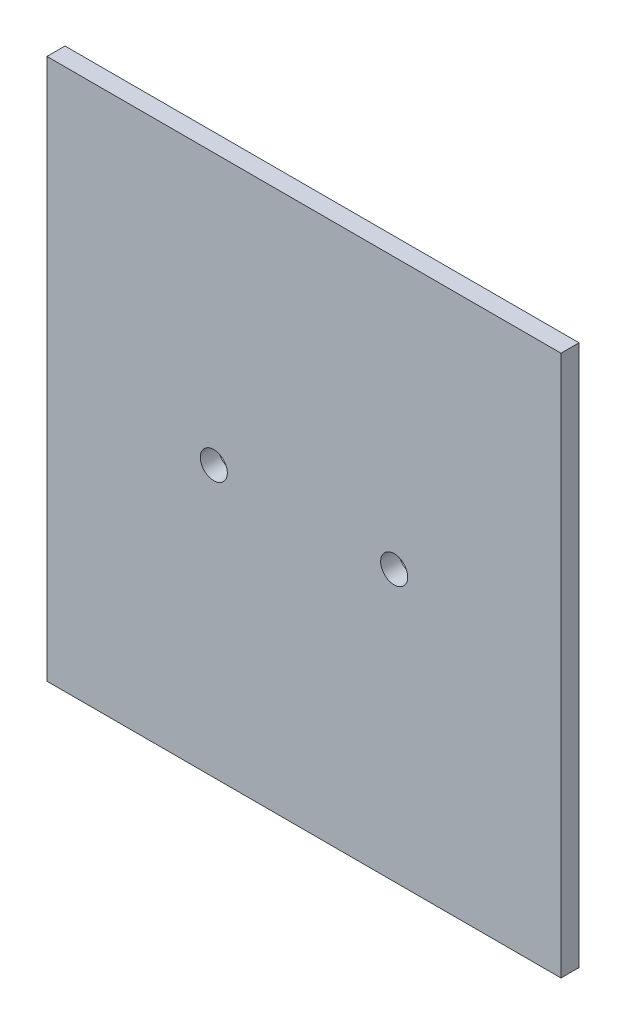
ISO-10303-21;
HEADER;
FILE_DESCRIPTION(('STEP AP214'),'2;1');
FILE_NAME('part.step','',(''),(''),'','','');
FILE_SCHEMA(('AUTOMOTIVE_DESIGN { 1 0 10303 214 1 1 1 1 }'));
ENDSEC;
DATA;
#1=APPLICATION_CONTEXT('core data for automotive mechanical design processes');
#2=APPLICATION_PROTOCOL_DEFINITION('international standard','automotive_design',2000,#1);
#3=PRODUCT_CONTEXT('',#1,'mechanical');
#4=PRODUCT('Part','Part','',(#3));
#5=PRODUCT_RELATED_PRODUCT_CATEGORY('part','',(#4));
#6=PRODUCT_DEFINITION_FORMATION('','',#4);
#7=PRODUCT_DEFINITION_CONTEXT('part definition',#1,'design');
#8=PRODUCT_DEFINITION('design','',#6,#7);
#9=PRODUCT_DEFINITION_SHAPE('','',#8);
#10=(LENGTH_UNIT() NAMED_UNIT(*) SI_UNIT(.MILLI.,.METRE.));
#11=(NAMED_UNIT(*) PLANE_ANGLE_UNIT() SI_UNIT($,.RADIAN.));
#12=(NAMED_UNIT(*) SI_UNIT($,.STERADIAN.) SOLID_ANGLE_UNIT());
#13=UNCERTAINTY_MEASURE_WITH_UNIT(LENGTH_MEASURE(1.E-05),#10,'distance_accuracy_value','');
#14=(GEOMETRIC_REPRESENTATION_CONTEXT(3) GLOBAL_UNCERTAINTY_ASSIGNED_CONTEXT((#13)) GLOBAL_UNIT_ASSIGNED_CONTEXT((#10,
#11,#12)) REPRESENTATION_CONTEXT('',''));
#15=CARTESIAN_POINT('',(0.,0.,0.));
#16=DIRECTION('',(0.,0.,1.));
#17=DIRECTION('',(1.,0.,0.));
#18=AXIS2_PLACEMENT_3D('',#15,#16,#17);
#19=CARTESIAN_POINT('',(0.,0.,2.));
#20=DIRECTION('',(0.,0.,-1.));
#21=DIRECTION('',(-1.,0.,0.));
#22=AXIS2_PLACEMENT_3D('',#19,#20,#21);
#23=PLANE('',#22);
#24=CARTESIAN_POINT('',(-10.,0.,2.));
#25=DIRECTION('',(0.,0.,1.));
#26=DIRECTION('',(1.,0.,0.));
#27=AXIS2_PLACEMENT_3D('',#24,#25,#26);
#28=CIRCLE('',#27,1.5);
#29=CARTESIAN_POINT('',(-8.5,0.,2.));
#30=VERTEX_POINT('',#29);
#31=EDGE_CURVE('E100',#30,#30,#28,.T.);
#32=ORIENTED_EDGE('',*,*,#31,.F.);
#33=EDGE_LOOP('',(#32));
#34=FACE_BOUND('',#33,.T.);
#35=DIRECTION('',(0.,1.,0.));
#36=VECTOR('',#35,1.);
#37=CARTESIAN_POINT('',(28.5,-30.,2.));
#38=LINE('',#37,#36);
#39=CARTESIAN_POINT('',(28.5,-30.,2.));
#40=VERTEX_POINT('',#39);
#41=CARTESIAN_POINT('',(28.5,30.,2.));
#42=VERTEX_POINT('',#41);
#43=EDGE_CURVE('E85',#40,#42,#38,.T.);
#44=ORIENTED_EDGE('',*,*,#43,.T.);
#45=DIRECTION('',(-1.,0.,0.));
#46=VECTOR('',#45,1.);
#47=CARTESIAN_POINT('',(-28.5,30.,2.));
#48=LINE('',#47,#46);
#49=CARTESIAN_POINT('',(-28.5,30.,2.));
#50=VERTEX_POINT('',#49);
#51=EDGE_CURVE('E80',#42,#50,#48,.T.);
#52=ORIENTED_EDGE('',*,*,#51,.T.);
#53=DIRECTION('',(0.,-1.,0.));
#54=VECTOR('',#53,1.);
#55=CARTESIAN_POINT('',(-28.5,-30.,2.));
#56=LINE('',#55,#54);
#57=CARTESIAN_POINT('',(-28.5,-30.,2.));
#58=VERTEX_POINT('',#57);
#59=EDGE_CURVE('E83',#50,#58,#56,.T.);
#60=ORIENTED_EDGE('',*,*,#59,.T.);
#61=DIRECTION('',(1.,0.,0.));
#62=VECTOR('',#61,1.);
#63=CARTESIAN_POINT('',(-28.5,-30.,2.));
#64=LINE('',#63,#62);
#65=EDGE_CURVE('E50',#58,#40,#64,.T.);
#66=ORIENTED_EDGE('',*,*,#65,.T.);
#67=EDGE_LOOP('',(#44,#52,#60,#66));
#68=FACE_BOUND('',#67,.T.);
#69=CARTESIAN_POINT('',(10.,0.,2.));
#70=DIRECTION('',(0.,0.,1.));
#71=DIRECTION('',(1.,0.,0.));
#72=AXIS2_PLACEMENT_3D('',#69,#70,#71);
#73=CIRCLE('',#72,1.5);
#74=CARTESIAN_POINT('',(11.5,0.,2.));
#75=VERTEX_POINT('',#74);
#76=EDGE_CURVE('E115',#75,#75,#73,.T.);
#77=ORIENTED_EDGE('',*,*,#76,.F.);
#78=EDGE_LOOP('',(#77));
#79=FACE_BOUND('',#78,.T.);
#80=ADVANCED_FACE('F33',(#34,#68,#79),#23,.F.);
#81=CARTESIAN_POINT('',(0.,0.,0.));
#82=DIRECTION('',(0.,0.,-1.));
#83=DIRECTION('',(-1.,0.,0.));
#84=AXIS2_PLACEMENT_3D('',#81,#82,#83);
#85=PLANE('',#84);
#86=CARTESIAN_POINT('',(-10.,0.,0.));
#87=DIRECTION('',(0.,0.,1.));
#88=DIRECTION('',(1.,0.,0.));
#89=AXIS2_PLACEMENT_3D('',#86,#87,#88);
#90=CIRCLE('',#89,1.5);
#91=CARTESIAN_POINT('',(-8.5,0.,0.));
#92=VERTEX_POINT('',#91);
#93=EDGE_CURVE('E112',#92,#92,#90,.T.);
#94=ORIENTED_EDGE('',*,*,#93,.T.);
#95=EDGE_LOOP('',(#94));
#96=FACE_BOUND('',#95,.T.);
#97=DIRECTION('',(0.,1.,0.));
#98=VECTOR('',#97,1.);
#99=CARTESIAN_POINT('',(28.5,-30.,0.));
#100=LINE('',#99,#98);
#101=CARTESIAN_POINT('',(28.5,-30.,0.));
#102=VERTEX_POINT('',#101);
#103=CARTESIAN_POINT('',(28.5,30.,0.));
#104=VERTEX_POINT('',#103);
#105=EDGE_CURVE('E97',#102,#104,#100,.T.);
#106=ORIENTED_EDGE('',*,*,#105,.F.);
#107=DIRECTION('',(1.,0.,0.));
#108=VECTOR('',#107,1.);
#109=CARTESIAN_POINT('',(-28.5,-30.,0.));
#110=LINE('',#109,#108);
#111=CARTESIAN_POINT('',(-28.5,-30.,0.));
#112=VERTEX_POINT('',#111);
#113=EDGE_CURVE('E73',#112,#102,#110,.T.);
#114=ORIENTED_EDGE('',*,*,#113,.F.);
#115=DIRECTION('',(0.,-1.,0.));
#116=VECTOR('',#115,1.);
#117=CARTESIAN_POINT('',(-28.5,-30.,0.));
#118=LINE('',#117,#116);
#119=CARTESIAN_POINT('',(-28.5,30.,0.));
#120=VERTEX_POINT('',#119);
#121=EDGE_CURVE('E67',#120,#112,#118,.T.);
#122=ORIENTED_EDGE('',*,*,#121,.F.);
#123=DIRECTION('',(-1.,0.,0.));
#124=VECTOR('',#123,1.);
#125=CARTESIAN_POINT('',(-28.5,30.,0.));
#126=LINE('',#125,#124);
#127=EDGE_CURVE('E89',#104,#120,#126,.T.);
#128=ORIENTED_EDGE('',*,*,#127,.F.);
#129=EDGE_LOOP('',(#106,#114,#122,#128));
#130=FACE_BOUND('',#129,.T.);
#131=CARTESIAN_POINT('',(10.,0.,0.));
#132=DIRECTION('',(0.,0.,1.));
#133=DIRECTION('',(1.,0.,0.));
#134=AXIS2_PLACEMENT_3D('',#131,#132,#133);
#135=CIRCLE('',#134,1.5);
#136=CARTESIAN_POINT('',(11.5,0.,0.));
#137=VERTEX_POINT('',#136);
#138=EDGE_CURVE('E118',#137,#137,#135,.T.);
#139=ORIENTED_EDGE('',*,*,#138,.T.);
#140=EDGE_LOOP('',(#139));
#141=FACE_BOUND('',#140,.T.);
#142=ADVANCED_FACE('F108',(#96,#130,#141),#85,.T.);
#143=CARTESIAN_POINT('',(28.5,-30.,2.));
#144=DIRECTION('',(-1.,0.,0.));
#145=DIRECTION('',(0.,0.,1.));
#146=AXIS2_PLACEMENT_3D('',#143,#144,#145);
#147=PLANE('',#146);
#148=ORIENTED_EDGE('',*,*,#105,.T.);
#149=DIRECTION('',(0.,0.,-1.));
#150=VECTOR('',#149,1.);
#151=CARTESIAN_POINT('',(28.5,30.,2.));
#152=LINE('',#151,#150);
#153=EDGE_CURVE('E11',#42,#104,#152,.T.);
#154=ORIENTED_EDGE('',*,*,#153,.F.);
#155=ORIENTED_EDGE('',*,*,#43,.F.);
#156=DIRECTION('',(0.,0.,-1.));
#157=VECTOR('',#156,1.);
#158=CARTESIAN_POINT('',(28.5,-30.,2.));
#159=LINE('',#158,#157);
#160=EDGE_CURVE('E93',#40,#102,#159,.T.);
#161=ORIENTED_EDGE('',*,*,#160,.T.);
#162=EDGE_LOOP('',(#148,#154,#155,#161));
#163=FACE_BOUND('',#162,.T.);
#164=ADVANCED_FACE('F35',(#163),#147,.F.);
#165=CARTESIAN_POINT('',(-28.5,30.,2.));
#166=DIRECTION('',(0.,-1.,0.));
#167=DIRECTION('',(0.,0.,-1.));
#168=AXIS2_PLACEMENT_3D('',#165,#166,#167);
#169=PLANE('',#168);
#170=ORIENTED_EDGE('',*,*,#127,.T.);
#171=DIRECTION('',(0.,0.,-1.));
#172=VECTOR('',#171,1.);
#173=CARTESIAN_POINT('',(-28.5,30.,2.));
#174=LINE('',#173,#172);
#175=EDGE_CURVE('E42',#50,#120,#174,.T.);
#176=ORIENTED_EDGE('',*,*,#175,.F.);
#177=ORIENTED_EDGE('',*,*,#51,.F.);
#178=ORIENTED_EDGE('',*,*,#153,.T.);
#179=EDGE_LOOP('',(#170,#176,#177,#178));
#180=FACE_BOUND('',#179,.T.);
#181=ADVANCED_FACE('F88',(#180),#169,.F.);
#182=CARTESIAN_POINT('',(-28.5,-30.,2.));
#183=DIRECTION('',(1.,0.,0.));
#184=DIRECTION('',(0.,0.,-1.));
#185=AXIS2_PLACEMENT_3D('',#182,#183,#184);
#186=PLANE('',#185);
#187=ORIENTED_EDGE('',*,*,#121,.T.);
#188=DIRECTION('',(0.,0.,-1.));
#189=VECTOR('',#188,1.);
#190=CARTESIAN_POINT('',(-28.5,-30.,2.));
#191=LINE('',#190,#189);
#192=EDGE_CURVE('E90',#58,#112,#191,.T.);
#193=ORIENTED_EDGE('',*,*,#192,.F.);
#194=ORIENTED_EDGE('',*,*,#59,.F.);
#195=ORIENTED_EDGE('',*,*,#175,.T.);
#196=EDGE_LOOP('',(#187,#193,#194,#195));
#197=FACE_BOUND('',#196,.T.);
#198=ADVANCED_FACE('F91',(#197),#186,.F.);
#199=CARTESIAN_POINT('',(-28.5,-30.,2.));
#200=DIRECTION('',(0.,1.,0.));
#201=DIRECTION('',(0.,0.,1.));
#202=AXIS2_PLACEMENT_3D('',#199,#200,#201);
#203=PLANE('',#202);
#204=ORIENTED_EDGE('',*,*,#113,.T.);
#205=ORIENTED_EDGE('',*,*,#160,.F.);
#206=ORIENTED_EDGE('',*,*,#65,.F.);
#207=ORIENTED_EDGE('',*,*,#192,.T.);
#208=EDGE_LOOP('',(#204,#205,#206,#207));
#209=FACE_BOUND('',#208,.T.);
#210=ADVANCED_FACE('F105',(#209),#203,.F.);
#211=CARTESIAN_POINT('',(-10.,0.,2.));
#212=DIRECTION('',(0.,0.,-1.));
#213=DIRECTION('',(-1.,0.,0.));
#214=AXIS2_PLACEMENT_3D('',#211,#212,#213);
#215=CYLINDRICAL_SURFACE('',#214,1.5);
#216=ORIENTED_EDGE('',*,*,#31,.T.);
#217=EDGE_LOOP('',(#216));
#218=FACE_BOUND('',#217,.T.);
#219=ORIENTED_EDGE('',*,*,#93,.F.);
#220=EDGE_LOOP('',(#219));
#221=FACE_BOUND('',#220,.T.);
#222=ADVANCED_FACE('F136',(#218,#221),#215,.F.);
#223=CARTESIAN_POINT('',(10.,0.,2.));
#224=DIRECTION('',(0.,0.,-1.));
#225=DIRECTION('',(-1.,0.,0.));
#226=AXIS2_PLACEMENT_3D('',#223,#224,#225);
#227=CYLINDRICAL_SURFACE('',#226,1.5);
#228=ORIENTED_EDGE('',*,*,#76,.T.);
#229=EDGE_LOOP('',(#228));
#230=FACE_BOUND('',#229,.T.);
#231=ORIENTED_EDGE('',*,*,#138,.F.);
#232=EDGE_LOOP('',(#231));
#233=FACE_BOUND('',#232,.T.);
#234=ADVANCED_FACE('F124',(#230,#233),#227,.F.);
#235=CLOSED_SHELL('',(#80,#142,#164,#181,#198,#210,#222,#234));
#236=MANIFOLD_SOLID_BREP('B2',#235);
#237=ADVANCED_BREP_SHAPE_REPRESENTATION('',(#18,#236),#14);
#238=SHAPE_DEFINITION_REPRESENTATION(#9,#237);
ENDSEC;
END-ISO-10303-21;
